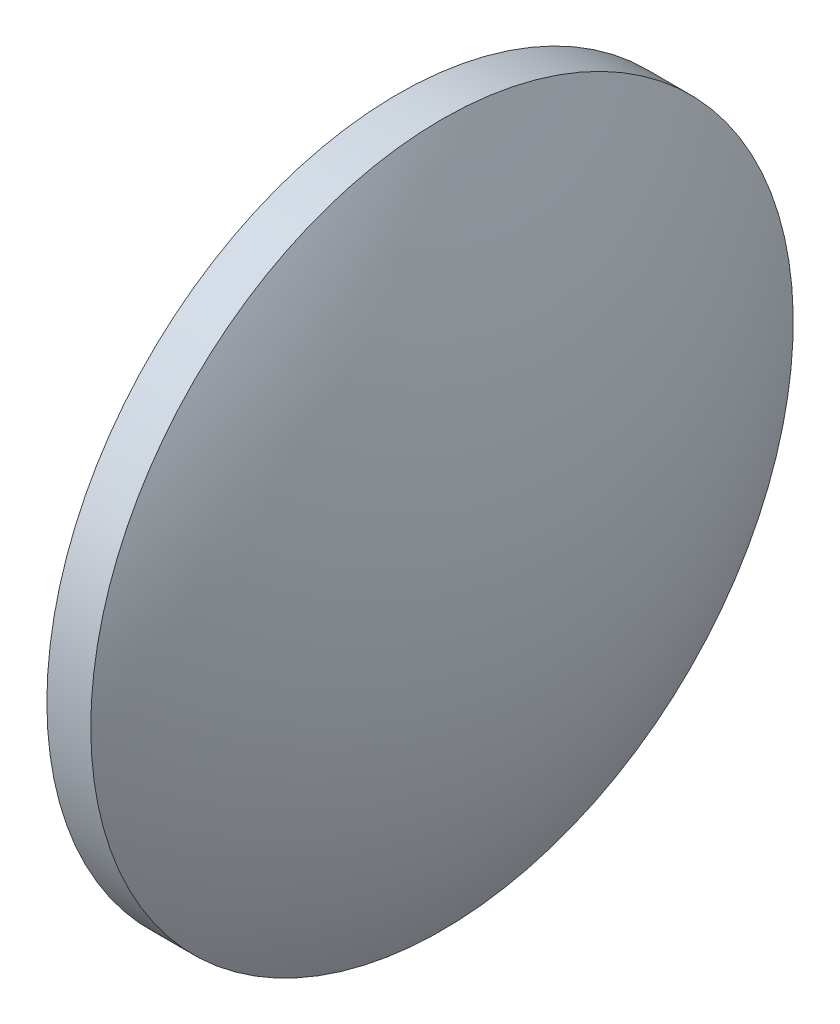
ISO-10303-21;
HEADER;
FILE_DESCRIPTION(('STEP AP214'),'2;1');
FILE_NAME('part.step','',(''),(''),'','','');
FILE_SCHEMA(('AUTOMOTIVE_DESIGN { 1 0 10303 214 1 1 1 1 }'));
ENDSEC;
DATA;
#1=APPLICATION_CONTEXT('core data for automotive mechanical design processes');
#2=APPLICATION_PROTOCOL_DEFINITION('international standard','automotive_design',2000,#1);
#3=PRODUCT_CONTEXT('',#1,'mechanical');
#4=PRODUCT('Part','Part','',(#3));
#5=PRODUCT_RELATED_PRODUCT_CATEGORY('part','',(#4));
#6=PRODUCT_DEFINITION_FORMATION('','',#4);
#7=PRODUCT_DEFINITION_CONTEXT('part definition',#1,'design');
#8=PRODUCT_DEFINITION('design','',#6,#7);
#9=PRODUCT_DEFINITION_SHAPE('','',#8);
#10=(LENGTH_UNIT() NAMED_UNIT(*) SI_UNIT(.MILLI.,.METRE.));
#11=(NAMED_UNIT(*) PLANE_ANGLE_UNIT() SI_UNIT($,.RADIAN.));
#12=(NAMED_UNIT(*) SI_UNIT($,.STERADIAN.) SOLID_ANGLE_UNIT());
#13=UNCERTAINTY_MEASURE_WITH_UNIT(LENGTH_MEASURE(1.E-05),#10,'distance_accuracy_value','');
#14=(GEOMETRIC_REPRESENTATION_CONTEXT(3) GLOBAL_UNCERTAINTY_ASSIGNED_CONTEXT((#13)) GLOBAL_UNIT_ASSIGNED_CONTEXT((#10,
#11,#12)) REPRESENTATION_CONTEXT('',''));
#15=CARTESIAN_POINT('',(0.,0.,0.));
#16=DIRECTION('',(0.,0.,1.));
#17=DIRECTION('',(1.,0.,0.));
#18=AXIS2_PLACEMENT_3D('',#15,#16,#17);
#19=CARTESIAN_POINT('',(413.743970257625,15.6860463174049,0.));
#20=DIRECTION('',(-1.,0.,0.));
#21=DIRECTION('',(0.,1.,0.));
#22=AXIS2_PLACEMENT_3D('',#19,#20,#21);
#23=SPHERICAL_SURFACE('',#22,41.2697195357834);
#24=CARTESIAN_POINT('',(449.843689793409,15.6860463174049,0.));
#25=DIRECTION('',(-1.,0.,0.));
#26=DIRECTION('',(0.,0.,1.));
#27=AXIS2_PLACEMENT_3D('',#24,#25,#26);
#28=CIRCLE('',#27,20.);
#29=CARTESIAN_POINT('',(449.843689793409,15.6860463174049,20.));
#30=VERTEX_POINT('',#29);
#31=EDGE_CURVE('E10',#30,#30,#28,.T.);
#32=ORIENTED_EDGE('',*,*,#31,.F.);
#33=EDGE_LOOP('',(#32));
#34=FACE_BOUND('',#33,.T.);
#35=ADVANCED_FACE('F35',(#34),#23,.T.);
#36=CARTESIAN_POINT('',(442.649146612832,15.6860463174049,0.));
#37=DIRECTION('',(-1.,0.,0.));
#38=DIRECTION('',(0.,0.,1.));
#39=AXIS2_PLACEMENT_3D('',#36,#37,#38);
#40=CYLINDRICAL_SURFACE('',#39,20.);
#41=CARTESIAN_POINT('',(447.343689793409,15.6860463174049,0.));
#42=DIRECTION('',(-1.,0.,0.));
#43=DIRECTION('',(0.,0.,1.));
#44=AXIS2_PLACEMENT_3D('',#41,#42,#43);
#45=CIRCLE('',#44,20.);
#46=CARTESIAN_POINT('',(447.343689793409,15.6860463174049,20.));
#47=VERTEX_POINT('',#46);
#48=EDGE_CURVE('E41',#47,#47,#45,.T.);
#49=ORIENTED_EDGE('',*,*,#48,.F.);
#50=EDGE_LOOP('',(#49));
#51=FACE_BOUND('',#50,.T.);
#52=ORIENTED_EDGE('',*,*,#31,.T.);
#53=EDGE_LOOP('',(#52));
#54=FACE_BOUND('',#53,.T.);
#55=ADVANCED_FACE('F49',(#51,#54),#40,.T.);
#56=CARTESIAN_POINT('',(447.343689793409,15.6860463174049,0.));
#57=DIRECTION('',(1.,0.,0.));
#58=DIRECTION('',(0.,0.,-1.));
#59=AXIS2_PLACEMENT_3D('',#56,#57,#58);
#60=PLANE('',#59);
#61=ORIENTED_EDGE('',*,*,#48,.T.);
#62=EDGE_LOOP('',(#61));
#63=FACE_BOUND('',#62,.T.);
#64=ADVANCED_FACE('F47',(#63),#60,.F.);
#65=CLOSED_SHELL('',(#35,#55,#64));
#66=MANIFOLD_SOLID_BREP('B2',#65);
#67=ADVANCED_BREP_SHAPE_REPRESENTATION('',(#18,#66),#14);
#68=SHAPE_DEFINITION_REPRESENTATION(#9,#67);
ENDSEC;
END-ISO-10303-21;
